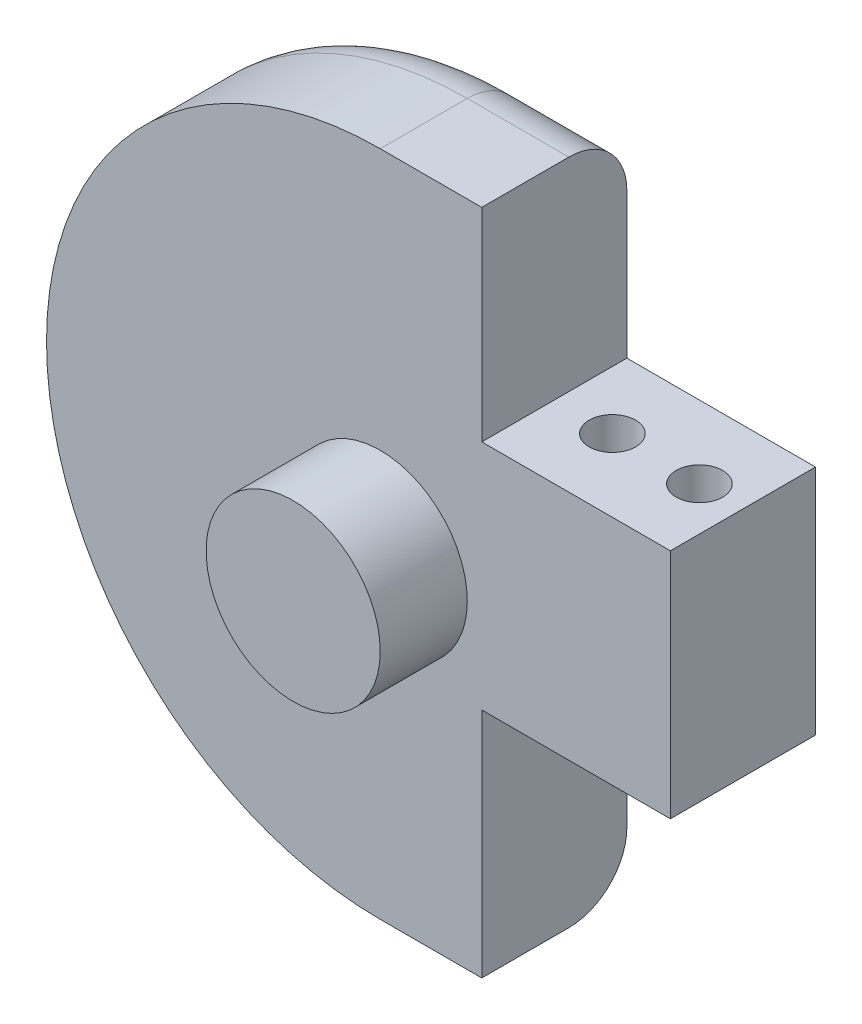
ISO-10303-21;
HEADER;
FILE_DESCRIPTION(('STEP AP214'),'2;1');
FILE_NAME('part.step','',(''),(''),'','','');
FILE_SCHEMA(('AUTOMOTIVE_DESIGN { 1 0 10303 214 1 1 1 1 }'));
ENDSEC;
DATA;
#1=APPLICATION_CONTEXT('core data for automotive mechanical design processes');
#2=APPLICATION_PROTOCOL_DEFINITION('international standard','automotive_design',2000,#1);
#3=PRODUCT_CONTEXT('',#1,'mechanical');
#4=PRODUCT('Part','Part','',(#3));
#5=PRODUCT_RELATED_PRODUCT_CATEGORY('part','',(#4));
#6=PRODUCT_DEFINITION_FORMATION('','',#4);
#7=PRODUCT_DEFINITION_CONTEXT('part definition',#1,'design');
#8=PRODUCT_DEFINITION('design','',#6,#7);
#9=PRODUCT_DEFINITION_SHAPE('','',#8);
#10=(LENGTH_UNIT() NAMED_UNIT(*) SI_UNIT(.MILLI.,.METRE.));
#11=(NAMED_UNIT(*) PLANE_ANGLE_UNIT() SI_UNIT($,.RADIAN.));
#12=(NAMED_UNIT(*) SI_UNIT($,.STERADIAN.) SOLID_ANGLE_UNIT());
#13=UNCERTAINTY_MEASURE_WITH_UNIT(LENGTH_MEASURE(1.E-05),#10,'distance_accuracy_value','');
#14=(GEOMETRIC_REPRESENTATION_CONTEXT(3) GLOBAL_UNCERTAINTY_ASSIGNED_CONTEXT((#13)) GLOBAL_UNIT_ASSIGNED_CONTEXT((#10,
#11,#12)) REPRESENTATION_CONTEXT('',''));
#15=CARTESIAN_POINT('',(0.,0.,0.));
#16=DIRECTION('',(0.,0.,1.));
#17=DIRECTION('',(1.,0.,0.));
#18=AXIS2_PLACEMENT_3D('',#15,#16,#17);
#19=CARTESIAN_POINT('',(0.,0.5,5.));
#20=DIRECTION('',(0.,0.,1.));
#21=DIRECTION('',(1.,0.,0.));
#22=AXIS2_PLACEMENT_3D('',#19,#20,#21);
#23=PLANE('',#22);
#24=CARTESIAN_POINT('',(0.,0.5,5.));
#25=DIRECTION('',(0.,0.,1.));
#26=DIRECTION('',(1.,0.,0.));
#27=AXIS2_PLACEMENT_3D('',#24,#25,#26);
#28=CIRCLE('',#27,11.5);
#29=CARTESIAN_POINT('',(0.,12.,5.));
#30=VERTEX_POINT('',#29);
#31=CARTESIAN_POINT('',(0.,-11.,5.));
#32=VERTEX_POINT('',#31);
#33=EDGE_CURVE('E118',#30,#32,#28,.T.);
#34=ORIENTED_EDGE('',*,*,#33,.T.);
#35=DIRECTION('',(1.,0.,0.));
#36=VECTOR('',#35,1.);
#37=CARTESIAN_POINT('',(0.,-11.,5.));
#38=LINE('',#37,#36);
#39=CARTESIAN_POINT('',(3.5,-11.,5.));
#40=VERTEX_POINT('',#39);
#41=EDGE_CURVE('E110',#32,#40,#38,.T.);
#42=ORIENTED_EDGE('',*,*,#41,.T.);
#43=DIRECTION('',(0.,1.,0.));
#44=VECTOR('',#43,1.);
#45=CARTESIAN_POINT('',(3.5,-3.,5.));
#46=LINE('',#45,#44);
#47=CARTESIAN_POINT('',(3.5,-3.,5.));
#48=VERTEX_POINT('',#47);
#49=EDGE_CURVE('E117',#40,#48,#46,.T.);
#50=ORIENTED_EDGE('',*,*,#49,.T.);
#51=DIRECTION('',(1.,0.,0.));
#52=VECTOR('',#51,1.);
#53=CARTESIAN_POINT('',(10.,-3.,5.));
#54=LINE('',#53,#52);
#55=CARTESIAN_POINT('',(10.,-3.,5.));
#56=VERTEX_POINT('',#55);
#57=EDGE_CURVE('E177',#48,#56,#54,.T.);
#58=ORIENTED_EDGE('',*,*,#57,.T.);
#59=DIRECTION('',(0.,1.,0.));
#60=VECTOR('',#59,1.);
#61=CARTESIAN_POINT('',(10.,5.,5.));
#62=LINE('',#61,#60);
#63=CARTESIAN_POINT('',(10.,5.,5.));
#64=VERTEX_POINT('',#63);
#65=EDGE_CURVE('E179',#56,#64,#62,.T.);
#66=ORIENTED_EDGE('',*,*,#65,.T.);
#67=DIRECTION('',(-1.,0.,0.));
#68=VECTOR('',#67,1.);
#69=CARTESIAN_POINT('',(3.5,5.,5.));
#70=LINE('',#69,#68);
#71=CARTESIAN_POINT('',(3.5,5.,5.));
#72=VERTEX_POINT('',#71);
#73=EDGE_CURVE('E181',#64,#72,#70,.T.);
#74=ORIENTED_EDGE('',*,*,#73,.T.);
#75=DIRECTION('',(0.,1.,0.));
#76=VECTOR('',#75,1.);
#77=CARTESIAN_POINT('',(3.5,12.,5.));
#78=LINE('',#77,#76);
#79=CARTESIAN_POINT('',(3.5,12.,5.));
#80=VERTEX_POINT('',#79);
#81=EDGE_CURVE('E183',#72,#80,#78,.T.);
#82=ORIENTED_EDGE('',*,*,#81,.T.);
#83=DIRECTION('',(-1.,0.,0.));
#84=VECTOR('',#83,1.);
#85=CARTESIAN_POINT('',(0.,12.,5.));
#86=LINE('',#85,#84);
#87=EDGE_CURVE('E123',#80,#30,#86,.T.);
#88=ORIENTED_EDGE('',*,*,#87,.T.);
#89=EDGE_LOOP('',(#34,#42,#50,#58,#66,#74,#82,#88));
#90=FACE_BOUND('',#89,.T.);
#91=CARTESIAN_POINT('',(0.,0.,5.));
#92=DIRECTION('',(0.,0.,1.));
#93=DIRECTION('',(1.,0.,0.));
#94=AXIS2_PLACEMENT_3D('',#91,#92,#93);
#95=CIRCLE('',#94,3.);
#96=CARTESIAN_POINT('',(3.,0.,5.));
#97=VERTEX_POINT('',#96);
#98=EDGE_CURVE('E160',#97,#97,#95,.T.);
#99=ORIENTED_EDGE('',*,*,#98,.F.);
#100=EDGE_LOOP('',(#99));
#101=FACE_BOUND('',#100,.T.);
#102=ADVANCED_FACE('F33',(#90,#101),#23,.T.);
#103=CARTESIAN_POINT('',(0.,0.5,5.));
#104=DIRECTION('',(0.,0.,-1.));
#105=DIRECTION('',(-1.,0.,0.));
#106=AXIS2_PLACEMENT_3D('',#103,#104,#105);
#107=CYLINDRICAL_SURFACE('',#106,11.5);
#108=DIRECTION('',(0.,0.,-1.));
#109=VECTOR('',#108,1.);
#110=CARTESIAN_POINT('',(0.,12.,5.));
#111=LINE('',#110,#109);
#112=CARTESIAN_POINT('',(0.,12.,2.));
#113=VERTEX_POINT('',#112);
#114=EDGE_CURVE('E186',#30,#113,#111,.T.);
#115=ORIENTED_EDGE('',*,*,#114,.T.);
#116=CARTESIAN_POINT('',(0.,0.5,2.));
#117=DIRECTION('',(0.,0.,1.));
#118=DIRECTION('',(1.,0.,0.));
#119=AXIS2_PLACEMENT_3D('',#116,#117,#118);
#120=CIRCLE('',#119,11.5);
#121=CARTESIAN_POINT('',(0.,-11.,2.));
#122=VERTEX_POINT('',#121);
#123=EDGE_CURVE('E11',#113,#122,#120,.T.);
#124=ORIENTED_EDGE('',*,*,#123,.T.);
#125=DIRECTION('',(0.,0.,-1.));
#126=VECTOR('',#125,1.);
#127=CARTESIAN_POINT('',(0.,-11.,5.));
#128=LINE('',#127,#126);
#129=EDGE_CURVE('E113',#32,#122,#128,.T.);
#130=ORIENTED_EDGE('',*,*,#129,.F.);
#131=ORIENTED_EDGE('',*,*,#33,.F.);
#132=EDGE_LOOP('',(#115,#124,#130,#131));
#133=FACE_BOUND('',#132,.T.);
#134=ADVANCED_FACE('F127',(#133),#107,.T.);
#135=CARTESIAN_POINT('',(0.,-11.,5.));
#136=DIRECTION('',(0.,1.,0.));
#137=DIRECTION('',(0.,0.,1.));
#138=AXIS2_PLACEMENT_3D('',#135,#136,#137);
#139=PLANE('',#138);
#140=ORIENTED_EDGE('',*,*,#129,.T.);
#141=DIRECTION('',(1.,0.,0.));
#142=VECTOR('',#141,1.);
#143=CARTESIAN_POINT('',(0.,-11.,2.));
#144=LINE('',#143,#142);
#145=CARTESIAN_POINT('',(3.5,-11.,2.));
#146=VERTEX_POINT('',#145);
#147=EDGE_CURVE('E55',#122,#146,#144,.T.);
#148=ORIENTED_EDGE('',*,*,#147,.T.);
#149=DIRECTION('',(0.,0.,-1.));
#150=VECTOR('',#149,1.);
#151=CARTESIAN_POINT('',(3.5,-11.,5.));
#152=LINE('',#151,#150);
#153=EDGE_CURVE('E114',#40,#146,#152,.T.);
#154=ORIENTED_EDGE('',*,*,#153,.F.);
#155=ORIENTED_EDGE('',*,*,#41,.F.);
#156=EDGE_LOOP('',(#140,#148,#154,#155));
#157=FACE_BOUND('',#156,.T.);
#158=ADVANCED_FACE('F112',(#157),#139,.F.);
#159=CARTESIAN_POINT('',(3.5,-3.,5.));
#160=DIRECTION('',(-1.,0.,0.));
#161=DIRECTION('',(0.,0.,1.));
#162=AXIS2_PLACEMENT_3D('',#159,#160,#161);
#163=PLANE('',#162);
#164=ORIENTED_EDGE('',*,*,#153,.T.);
#165=CARTESIAN_POINT('',(3.5,-9.,2.));
#166=DIRECTION('',(-1.,0.,0.));
#167=DIRECTION('',(0.,0.,1.));
#168=AXIS2_PLACEMENT_3D('',#165,#166,#167);
#169=CIRCLE('',#168,2.);
#170=CARTESIAN_POINT('',(3.5,-9.,0.));
#171=VERTEX_POINT('',#170);
#172=EDGE_CURVE('E42',#146,#171,#169,.F.);
#173=ORIENTED_EDGE('',*,*,#172,.T.);
#174=DIRECTION('',(0.,1.,0.));
#175=VECTOR('',#174,1.);
#176=CARTESIAN_POINT('',(3.5,-3.,0.));
#177=LINE('',#176,#175);
#178=CARTESIAN_POINT('',(3.5,-3.,0.));
#179=VERTEX_POINT('',#178);
#180=EDGE_CURVE('E174',#171,#179,#177,.T.);
#181=ORIENTED_EDGE('',*,*,#180,.T.);
#182=DIRECTION('',(0.,0.,-1.));
#183=VECTOR('',#182,1.);
#184=CARTESIAN_POINT('',(3.5,-3.,5.));
#185=LINE('',#184,#183);
#186=EDGE_CURVE('E133',#48,#179,#185,.T.);
#187=ORIENTED_EDGE('',*,*,#186,.F.);
#188=ORIENTED_EDGE('',*,*,#49,.F.);
#189=EDGE_LOOP('',(#164,#173,#181,#187,#188));
#190=FACE_BOUND('',#189,.T.);
#191=ADVANCED_FACE('F233',(#190),#163,.F.);
#192=CARTESIAN_POINT('',(10.,-3.,5.));
#193=DIRECTION('',(0.,1.,0.));
#194=DIRECTION('',(0.,0.,1.));
#195=AXIS2_PLACEMENT_3D('',#192,#193,#194);
#196=PLANE('',#195);
#197=CARTESIAN_POINT('',(5.5,-3.,2.5));
#198=DIRECTION('',(0.,1.,0.));
#199=DIRECTION('',(0.,0.,1.));
#200=AXIS2_PLACEMENT_3D('',#197,#198,#199);
#201=CIRCLE('',#200,0.8);
#202=CARTESIAN_POINT('',(5.5,-3.,3.3));
#203=VERTEX_POINT('',#202);
#204=EDGE_CURVE('E141',#203,#203,#201,.T.);
#205=ORIENTED_EDGE('',*,*,#204,.T.);
#206=EDGE_LOOP('',(#205));
#207=FACE_BOUND('',#206,.T.);
#208=CARTESIAN_POINT('',(8.5,-3.,2.5));
#209=DIRECTION('',(0.,1.,0.));
#210=DIRECTION('',(0.,0.,1.));
#211=AXIS2_PLACEMENT_3D('',#208,#209,#210);
#212=CIRCLE('',#211,0.799999999999999);
#213=CARTESIAN_POINT('',(8.5,-3.,3.3));
#214=VERTEX_POINT('',#213);
#215=EDGE_CURVE('E140',#214,#214,#212,.T.);
#216=ORIENTED_EDGE('',*,*,#215,.T.);
#217=EDGE_LOOP('',(#216));
#218=FACE_BOUND('',#217,.T.);
#219=DIRECTION('',(1.,0.,0.));
#220=VECTOR('',#219,1.);
#221=CARTESIAN_POINT('',(10.,-3.,0.));
#222=LINE('',#221,#220);
#223=CARTESIAN_POINT('',(10.,-3.,0.));
#224=VERTEX_POINT('',#223);
#225=EDGE_CURVE('E188',#179,#224,#222,.T.);
#226=ORIENTED_EDGE('',*,*,#225,.T.);
#227=DIRECTION('',(0.,0.,-1.));
#228=VECTOR('',#227,1.);
#229=CARTESIAN_POINT('',(10.,-3.,5.));
#230=LINE('',#229,#228);
#231=EDGE_CURVE('E206',#56,#224,#230,.T.);
#232=ORIENTED_EDGE('',*,*,#231,.F.);
#233=ORIENTED_EDGE('',*,*,#57,.F.);
#234=ORIENTED_EDGE('',*,*,#186,.T.);
#235=EDGE_LOOP('',(#226,#232,#233,#234));
#236=FACE_BOUND('',#235,.T.);
#237=ADVANCED_FACE('F213',(#207,#218,#236),#196,.F.);
#238=CARTESIAN_POINT('',(10.,5.,5.));
#239=DIRECTION('',(-1.,0.,0.));
#240=DIRECTION('',(0.,0.,1.));
#241=AXIS2_PLACEMENT_3D('',#238,#239,#240);
#242=PLANE('',#241);
#243=DIRECTION('',(0.,1.,0.));
#244=VECTOR('',#243,1.);
#245=CARTESIAN_POINT('',(10.,5.,0.));
#246=LINE('',#245,#244);
#247=CARTESIAN_POINT('',(10.,5.,0.));
#248=VERTEX_POINT('',#247);
#249=EDGE_CURVE('E190',#224,#248,#246,.T.);
#250=ORIENTED_EDGE('',*,*,#249,.T.);
#251=DIRECTION('',(0.,0.,-1.));
#252=VECTOR('',#251,1.);
#253=CARTESIAN_POINT('',(10.,5.,5.));
#254=LINE('',#253,#252);
#255=EDGE_CURVE('E203',#64,#248,#254,.T.);
#256=ORIENTED_EDGE('',*,*,#255,.F.);
#257=ORIENTED_EDGE('',*,*,#65,.F.);
#258=ORIENTED_EDGE('',*,*,#231,.T.);
#259=EDGE_LOOP('',(#250,#256,#257,#258));
#260=FACE_BOUND('',#259,.T.);
#261=ADVANCED_FACE('F225',(#260),#242,.F.);
#262=CARTESIAN_POINT('',(3.5,5.,5.));
#263=DIRECTION('',(0.,-1.,0.));
#264=DIRECTION('',(0.,0.,-1.));
#265=AXIS2_PLACEMENT_3D('',#262,#263,#264);
#266=PLANE('',#265);
#267=CARTESIAN_POINT('',(5.5,5.,2.5));
#268=DIRECTION('',(0.,-1.,0.));
#269=DIRECTION('',(0.,0.,-1.));
#270=AXIS2_PLACEMENT_3D('',#267,#268,#269);
#271=CIRCLE('',#270,0.8);
#272=CARTESIAN_POINT('',(5.5,5.,1.7));
#273=VERTEX_POINT('',#272);
#274=EDGE_CURVE('E142',#273,#273,#271,.T.);
#275=ORIENTED_EDGE('',*,*,#274,.T.);
#276=EDGE_LOOP('',(#275));
#277=FACE_BOUND('',#276,.T.);
#278=CARTESIAN_POINT('',(8.5,5.,2.5));
#279=DIRECTION('',(0.,-1.,0.));
#280=DIRECTION('',(0.,0.,-1.));
#281=AXIS2_PLACEMENT_3D('',#278,#279,#280);
#282=CIRCLE('',#281,0.799999999999999);
#283=CARTESIAN_POINT('',(8.5,5.,1.7));
#284=VERTEX_POINT('',#283);
#285=EDGE_CURVE('E137',#284,#284,#282,.T.);
#286=ORIENTED_EDGE('',*,*,#285,.T.);
#287=EDGE_LOOP('',(#286));
#288=FACE_BOUND('',#287,.T.);
#289=DIRECTION('',(-1.,0.,0.));
#290=VECTOR('',#289,1.);
#291=CARTESIAN_POINT('',(3.5,5.,0.));
#292=LINE('',#291,#290);
#293=CARTESIAN_POINT('',(3.5,5.,0.));
#294=VERTEX_POINT('',#293);
#295=EDGE_CURVE('E192',#248,#294,#292,.T.);
#296=ORIENTED_EDGE('',*,*,#295,.T.);
#297=DIRECTION('',(0.,0.,-1.));
#298=VECTOR('',#297,1.);
#299=CARTESIAN_POINT('',(3.5,5.,5.));
#300=LINE('',#299,#298);
#301=EDGE_CURVE('E200',#72,#294,#300,.T.);
#302=ORIENTED_EDGE('',*,*,#301,.F.);
#303=ORIENTED_EDGE('',*,*,#73,.F.);
#304=ORIENTED_EDGE('',*,*,#255,.T.);
#305=EDGE_LOOP('',(#296,#302,#303,#304));
#306=FACE_BOUND('',#305,.T.);
#307=ADVANCED_FACE('F229',(#277,#288,#306),#266,.F.);
#308=CARTESIAN_POINT('',(3.5,12.,5.));
#309=DIRECTION('',(-1.,0.,0.));
#310=DIRECTION('',(0.,0.,1.));
#311=AXIS2_PLACEMENT_3D('',#308,#309,#310);
#312=PLANE('',#311);
#313=DIRECTION('',(0.,1.,0.));
#314=VECTOR('',#313,1.);
#315=CARTESIAN_POINT('',(3.5,12.,0.));
#316=LINE('',#315,#314);
#317=CARTESIAN_POINT('',(3.5,10.,0.));
#318=VERTEX_POINT('',#317);
#319=EDGE_CURVE('E125',#294,#318,#316,.T.);
#320=ORIENTED_EDGE('',*,*,#319,.T.);
#321=CARTESIAN_POINT('',(3.5,10.,2.));
#322=DIRECTION('',(-1.,0.,0.));
#323=DIRECTION('',(0.,0.,1.));
#324=AXIS2_PLACEMENT_3D('',#321,#322,#323);
#325=CIRCLE('',#324,2.);
#326=CARTESIAN_POINT('',(3.5,12.,2.));
#327=VERTEX_POINT('',#326);
#328=EDGE_CURVE('E151',#318,#327,#325,.F.);
#329=ORIENTED_EDGE('',*,*,#328,.T.);
#330=DIRECTION('',(0.,0.,-1.));
#331=VECTOR('',#330,1.);
#332=CARTESIAN_POINT('',(3.5,12.,5.));
#333=LINE('',#332,#331);
#334=EDGE_CURVE('E197',#80,#327,#333,.T.);
#335=ORIENTED_EDGE('',*,*,#334,.F.);
#336=ORIENTED_EDGE('',*,*,#81,.F.);
#337=ORIENTED_EDGE('',*,*,#301,.T.);
#338=EDGE_LOOP('',(#320,#329,#335,#336,#337));
#339=FACE_BOUND('',#338,.T.);
#340=ADVANCED_FACE('F242',(#339),#312,.F.);
#341=CARTESIAN_POINT('',(0.,12.,5.));
#342=DIRECTION('',(0.,-1.,0.));
#343=DIRECTION('',(0.,0.,-1.));
#344=AXIS2_PLACEMENT_3D('',#341,#342,#343);
#345=PLANE('',#344);
#346=ORIENTED_EDGE('',*,*,#334,.T.);
#347=DIRECTION('',(-1.,0.,0.));
#348=VECTOR('',#347,1.);
#349=CARTESIAN_POINT('',(0.,12.,2.));
#350=LINE('',#349,#348);
#351=EDGE_CURVE('E128',#327,#113,#350,.T.);
#352=ORIENTED_EDGE('',*,*,#351,.T.);
#353=ORIENTED_EDGE('',*,*,#114,.F.);
#354=ORIENTED_EDGE('',*,*,#87,.F.);
#355=EDGE_LOOP('',(#346,#352,#353,#354));
#356=FACE_BOUND('',#355,.T.);
#357=ADVANCED_FACE('F240',(#356),#345,.F.);
#358=CARTESIAN_POINT('',(0.,0.5,0.));
#359=DIRECTION('',(0.,0.,1.));
#360=DIRECTION('',(1.,0.,0.));
#361=AXIS2_PLACEMENT_3D('',#358,#359,#360);
#362=PLANE('',#361);
#363=CARTESIAN_POINT('',(0.,0.5,0.));
#364=DIRECTION('',(0.,0.,1.));
#365=DIRECTION('',(1.,0.,0.));
#366=AXIS2_PLACEMENT_3D('',#363,#364,#365);
#367=CIRCLE('',#366,9.5);
#368=CARTESIAN_POINT('',(0.,-9.,0.));
#369=VERTEX_POINT('',#368);
#370=CARTESIAN_POINT('',(0.,10.,0.));
#371=VERTEX_POINT('',#370);
#372=EDGE_CURVE('E131',#369,#371,#367,.F.);
#373=ORIENTED_EDGE('',*,*,#372,.T.);
#374=DIRECTION('',(-1.,0.,0.));
#375=VECTOR('',#374,1.);
#376=CARTESIAN_POINT('',(0.,10.,0.));
#377=LINE('',#376,#375);
#378=EDGE_CURVE('E149',#371,#318,#377,.F.);
#379=ORIENTED_EDGE('',*,*,#378,.T.);
#380=ORIENTED_EDGE('',*,*,#319,.F.);
#381=ORIENTED_EDGE('',*,*,#295,.F.);
#382=ORIENTED_EDGE('',*,*,#249,.F.);
#383=ORIENTED_EDGE('',*,*,#225,.F.);
#384=ORIENTED_EDGE('',*,*,#180,.F.);
#385=DIRECTION('',(1.,0.,0.));
#386=VECTOR('',#385,1.);
#387=CARTESIAN_POINT('',(0.,-9.,0.));
#388=LINE('',#387,#386);
#389=EDGE_CURVE('E147',#171,#369,#388,.F.);
#390=ORIENTED_EDGE('',*,*,#389,.T.);
#391=EDGE_LOOP('',(#373,#379,#380,#381,#382,#383,#384,#390));
#392=FACE_BOUND('',#391,.T.);
#393=ADVANCED_FACE('F219',(#392),#362,.F.);
#394=CARTESIAN_POINT('',(8.5,-11.,2.5));
#395=DIRECTION('',(0.,1.,0.));
#396=DIRECTION('',(0.,0.,1.));
#397=AXIS2_PLACEMENT_3D('',#394,#395,#396);
#398=CYLINDRICAL_SURFACE('',#397,0.799999999999999);
#399=ORIENTED_EDGE('',*,*,#285,.F.);
#400=EDGE_LOOP('',(#399));
#401=FACE_BOUND('',#400,.T.);
#402=ORIENTED_EDGE('',*,*,#215,.F.);
#403=EDGE_LOOP('',(#402));
#404=FACE_BOUND('',#403,.T.);
#405=ADVANCED_FACE('F260',(#401,#404),#398,.F.);
#406=CARTESIAN_POINT('',(5.5,-11.,2.5));
#407=DIRECTION('',(0.,1.,0.));
#408=DIRECTION('',(0.,0.,1.));
#409=AXIS2_PLACEMENT_3D('',#406,#407,#408);
#410=CYLINDRICAL_SURFACE('',#409,0.8);
#411=ORIENTED_EDGE('',*,*,#274,.F.);
#412=EDGE_LOOP('',(#411));
#413=FACE_BOUND('',#412,.T.);
#414=ORIENTED_EDGE('',*,*,#204,.F.);
#415=EDGE_LOOP('',(#414));
#416=FACE_BOUND('',#415,.T.);
#417=ADVANCED_FACE('F266',(#413,#416),#410,.F.);
#418=CARTESIAN_POINT('',(0.,0.,8.));
#419=DIRECTION('',(0.,0.,-1.));
#420=DIRECTION('',(-1.,0.,0.));
#421=AXIS2_PLACEMENT_3D('',#418,#419,#420);
#422=CYLINDRICAL_SURFACE('',#421,3.);
#423=CARTESIAN_POINT('',(0.,0.,8.));
#424=DIRECTION('',(0.,0.,1.));
#425=DIRECTION('',(1.,0.,0.));
#426=AXIS2_PLACEMENT_3D('',#423,#424,#425);
#427=CIRCLE('',#426,3.);
#428=CARTESIAN_POINT('',(3.,0.,8.));
#429=VERTEX_POINT('',#428);
#430=EDGE_CURVE('E144',#429,#429,#427,.T.);
#431=ORIENTED_EDGE('',*,*,#430,.F.);
#432=EDGE_LOOP('',(#431));
#433=FACE_BOUND('',#432,.T.);
#434=ORIENTED_EDGE('',*,*,#98,.T.);
#435=EDGE_LOOP('',(#434));
#436=FACE_BOUND('',#435,.T.);
#437=ADVANCED_FACE('F271',(#433,#436),#422,.T.);
#438=CARTESIAN_POINT('',(0.,0.,8.));
#439=DIRECTION('',(0.,0.,1.));
#440=DIRECTION('',(1.,0.,0.));
#441=AXIS2_PLACEMENT_3D('',#438,#439,#440);
#442=PLANE('',#441);
#443=ORIENTED_EDGE('',*,*,#430,.T.);
#444=EDGE_LOOP('',(#443));
#445=FACE_BOUND('',#444,.T.);
#446=ADVANCED_FACE('F294',(#445),#442,.T.);
#447=CARTESIAN_POINT('',(0.,-9.,2.));
#448=DIRECTION('',(1.,0.,0.));
#449=DIRECTION('',(0.,0.,-1.));
#450=AXIS2_PLACEMENT_3D('',#447,#448,#449);
#451=CYLINDRICAL_SURFACE('',#450,2.);
#452=ORIENTED_EDGE('',*,*,#172,.F.);
#453=ORIENTED_EDGE('',*,*,#147,.F.);
#454=CARTESIAN_POINT('',(0.,-9.,2.));
#455=DIRECTION('',(-1.,0.,0.));
#456=DIRECTION('',(0.,0.,1.));
#457=AXIS2_PLACEMENT_3D('',#454,#455,#456);
#458=CIRCLE('',#457,2.);
#459=EDGE_CURVE('E37',#369,#122,#458,.T.);
#460=ORIENTED_EDGE('',*,*,#459,.F.);
#461=ORIENTED_EDGE('',*,*,#389,.F.);
#462=EDGE_LOOP('',(#452,#453,#460,#461));
#463=FACE_BOUND('',#462,.T.);
#464=ADVANCED_FACE('F35',(#463),#451,.T.);
#465=CARTESIAN_POINT('',(0.,0.5,2.));
#466=DIRECTION('',(0.,0.,1.));
#467=DIRECTION('',(1.,0.,0.));
#468=AXIS2_PLACEMENT_3D('',#465,#466,#467);
#469=TOROIDAL_SURFACE('',#468,9.5,2.);
#470=ORIENTED_EDGE('',*,*,#459,.T.);
#471=ORIENTED_EDGE('',*,*,#123,.F.);
#472=CARTESIAN_POINT('',(0.,10.,2.));
#473=DIRECTION('',(1.,0.,0.));
#474=DIRECTION('',(0.,0.,-1.));
#475=AXIS2_PLACEMENT_3D('',#472,#473,#474);
#476=CIRCLE('',#475,2.);
#477=EDGE_CURVE('E154',#371,#113,#476,.T.);
#478=ORIENTED_EDGE('',*,*,#477,.F.);
#479=ORIENTED_EDGE('',*,*,#372,.F.);
#480=EDGE_LOOP('',(#470,#471,#478,#479));
#481=FACE_BOUND('',#480,.T.);
#482=ADVANCED_FACE('F238',(#481),#469,.T.);
#483=CARTESIAN_POINT('',(0.,10.,2.));
#484=DIRECTION('',(-1.,0.,0.));
#485=DIRECTION('',(0.,0.,1.));
#486=AXIS2_PLACEMENT_3D('',#483,#484,#485);
#487=CYLINDRICAL_SURFACE('',#486,2.);
#488=ORIENTED_EDGE('',*,*,#328,.F.);
#489=ORIENTED_EDGE('',*,*,#378,.F.);
#490=ORIENTED_EDGE('',*,*,#477,.T.);
#491=ORIENTED_EDGE('',*,*,#351,.F.);
#492=EDGE_LOOP('',(#488,#489,#490,#491));
#493=FACE_BOUND('',#492,.T.);
#494=ADVANCED_FACE('F237',(#493),#487,.T.);
#495=CLOSED_SHELL('',(#102,#134,#158,#191,#237,#261,#307,#340,#357,#393,#405,#417,#437,#446,
#464,#482,#494));
#496=MANIFOLD_SOLID_BREP('B2',#495);
#497=ADVANCED_BREP_SHAPE_REPRESENTATION('',(#18,#496),#14);
#498=SHAPE_DEFINITION_REPRESENTATION(#9,#497);
ENDSEC;
END-ISO-10303-21;
